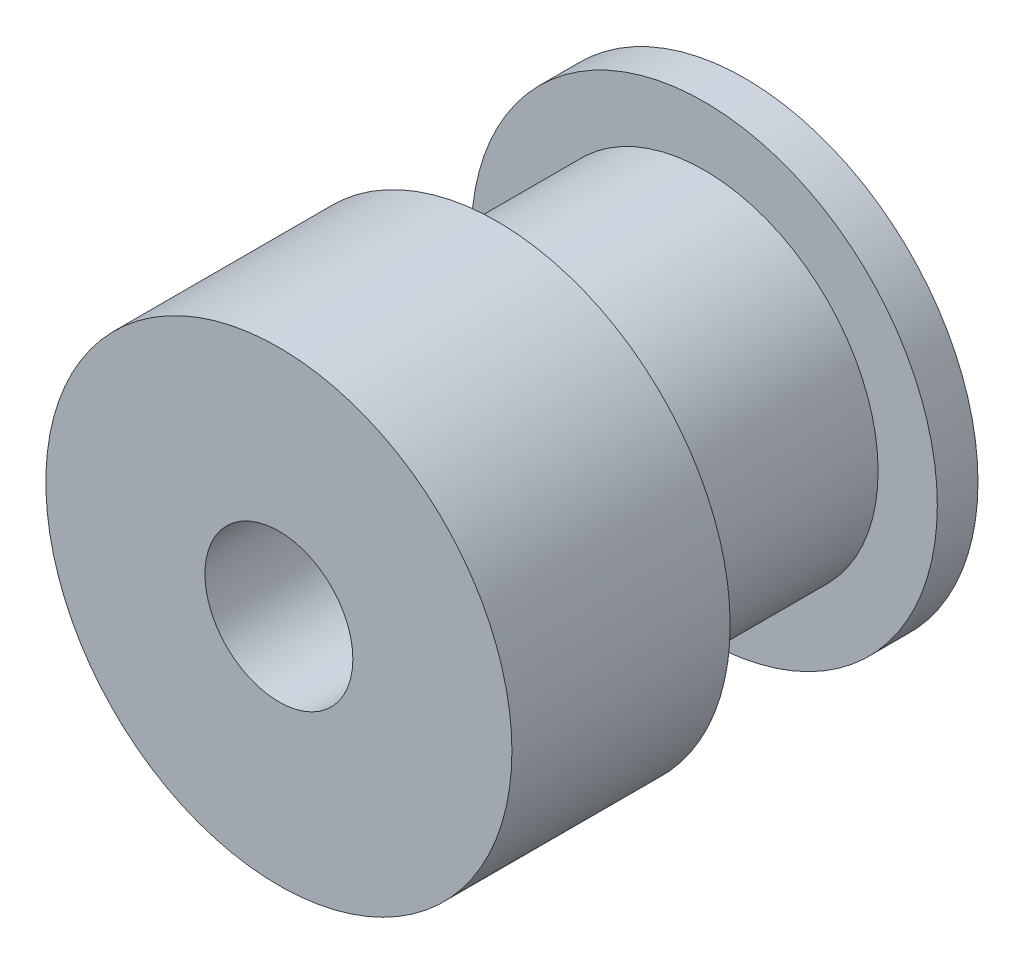
ISO-10303-21;
HEADER;
FILE_DESCRIPTION(('STEP AP214'),'2;1');
FILE_NAME('part.step','',(''),(''),'','','');
FILE_SCHEMA(('AUTOMOTIVE_DESIGN { 1 0 10303 214 1 1 1 1 }'));
ENDSEC;
DATA;
#1=APPLICATION_CONTEXT('core data for automotive mechanical design processes');
#2=APPLICATION_PROTOCOL_DEFINITION('international standard','automotive_design',2000,#1);
#3=PRODUCT_CONTEXT('',#1,'mechanical');
#4=PRODUCT('Part','Part','',(#3));
#5=PRODUCT_RELATED_PRODUCT_CATEGORY('part','',(#4));
#6=PRODUCT_DEFINITION_FORMATION('','',#4);
#7=PRODUCT_DEFINITION_CONTEXT('part definition',#1,'design');
#8=PRODUCT_DEFINITION('design','',#6,#7);
#9=PRODUCT_DEFINITION_SHAPE('','',#8);
#10=(LENGTH_UNIT() NAMED_UNIT(*) SI_UNIT(.MILLI.,.METRE.));
#11=(NAMED_UNIT(*) PLANE_ANGLE_UNIT() SI_UNIT($,.RADIAN.));
#12=(NAMED_UNIT(*) SI_UNIT($,.STERADIAN.) SOLID_ANGLE_UNIT());
#13=UNCERTAINTY_MEASURE_WITH_UNIT(LENGTH_MEASURE(1.E-05),#10,'distance_accuracy_value','');
#14=(GEOMETRIC_REPRESENTATION_CONTEXT(3) GLOBAL_UNCERTAINTY_ASSIGNED_CONTEXT((#13)) GLOBAL_UNIT_ASSIGNED_CONTEXT((#10,
#11,#12)) REPRESENTATION_CONTEXT('',''));
#15=CARTESIAN_POINT('',(0.,0.,0.));
#16=DIRECTION('',(0.,0.,1.));
#17=DIRECTION('',(1.,0.,0.));
#18=AXIS2_PLACEMENT_3D('',#15,#16,#17);
#19=CARTESIAN_POINT('',(8.001,0.,0.));
#20=DIRECTION('',(0.,0.,1.));
#21=DIRECTION('',(1.,0.,0.));
#22=AXIS2_PLACEMENT_3D('',#19,#20,#21);
#23=PLANE('',#22);
#24=CARTESIAN_POINT('',(0.,0.,0.));
#25=DIRECTION('',(0.,0.,1.));
#26=DIRECTION('',(1.,0.,0.));
#27=AXIS2_PLACEMENT_3D('',#24,#25,#26);
#28=CIRCLE('',#27,8.001);
#29=CARTESIAN_POINT('',(8.001,0.,0.));
#30=VERTEX_POINT('',#29);
#31=EDGE_CURVE('E65',#30,#30,#28,.T.);
#32=ORIENTED_EDGE('',*,*,#31,.T.);
#33=EDGE_LOOP('',(#32));
#34=FACE_BOUND('',#33,.T.);
#35=CARTESIAN_POINT('',(0.,0.,0.));
#36=DIRECTION('',(0.,0.,1.));
#37=DIRECTION('',(1.,0.,0.));
#38=AXIS2_PLACEMENT_3D('',#35,#36,#37);
#39=CIRCLE('',#38,2.54);
#40=CARTESIAN_POINT('',(2.54,0.,0.));
#41=VERTEX_POINT('',#40);
#42=EDGE_CURVE('E10',#41,#41,#39,.T.);
#43=ORIENTED_EDGE('',*,*,#42,.F.);
#44=EDGE_LOOP('',(#43));
#45=FACE_BOUND('',#44,.T.);
#46=ADVANCED_FACE('F37',(#34,#45),#23,.T.);
#47=CARTESIAN_POINT('',(0.,0.,0.169544175264491));
#48=DIRECTION('',(0.,0.,1.));
#49=DIRECTION('',(1.,0.,0.));
#50=AXIS2_PLACEMENT_3D('',#47,#48,#49);
#51=CYLINDRICAL_SURFACE('',#50,2.54);
#52=ORIENTED_EDGE('',*,*,#42,.T.);
#53=EDGE_LOOP('',(#52));
#54=FACE_BOUND('',#53,.T.);
#55=CARTESIAN_POINT('',(0.,0.,-16.002));
#56=DIRECTION('',(0.,0.,1.));
#57=DIRECTION('',(1.,0.,0.));
#58=AXIS2_PLACEMENT_3D('',#55,#56,#57);
#59=CIRCLE('',#58,2.54);
#60=CARTESIAN_POINT('',(2.54,0.,-16.002));
#61=VERTEX_POINT('',#60);
#62=EDGE_CURVE('E43',#61,#61,#59,.T.);
#63=ORIENTED_EDGE('',*,*,#62,.F.);
#64=EDGE_LOOP('',(#63));
#65=FACE_BOUND('',#64,.T.);
#66=ADVANCED_FACE('F83',(#54,#65),#51,.F.);
#67=CARTESIAN_POINT('',(2.54,0.,-16.002));
#68=DIRECTION('',(0.,0.,-1.));
#69=DIRECTION('',(-1.,0.,0.));
#70=AXIS2_PLACEMENT_3D('',#67,#68,#69);
#71=PLANE('',#70);
#72=ORIENTED_EDGE('',*,*,#62,.T.);
#73=EDGE_LOOP('',(#72));
#74=FACE_BOUND('',#73,.T.);
#75=CARTESIAN_POINT('',(0.,0.,-16.002));
#76=DIRECTION('',(0.,0.,1.));
#77=DIRECTION('',(1.,0.,0.));
#78=AXIS2_PLACEMENT_3D('',#75,#76,#77);
#79=CIRCLE('',#78,8.001);
#80=CARTESIAN_POINT('',(8.001,0.,-16.002));
#81=VERTEX_POINT('',#80);
#82=EDGE_CURVE('E47',#81,#81,#79,.T.);
#83=ORIENTED_EDGE('',*,*,#82,.F.);
#84=EDGE_LOOP('',(#83));
#85=FACE_BOUND('',#84,.T.);
#86=ADVANCED_FACE('F87',(#74,#85),#71,.T.);
#87=CARTESIAN_POINT('',(0.,0.,0.169544175264491));
#88=DIRECTION('',(0.,0.,1.));
#89=DIRECTION('',(1.,0.,0.));
#90=AXIS2_PLACEMENT_3D('',#87,#88,#89);
#91=CYLINDRICAL_SURFACE('',#90,8.001);
#92=ORIENTED_EDGE('',*,*,#82,.T.);
#93=EDGE_LOOP('',(#92));
#94=FACE_BOUND('',#93,.T.);
#95=CARTESIAN_POINT('',(0.,0.,-14.605));
#96=DIRECTION('',(0.,0.,1.));
#97=DIRECTION('',(1.,0.,0.));
#98=AXIS2_PLACEMENT_3D('',#95,#96,#97);
#99=CIRCLE('',#98,8.001);
#100=CARTESIAN_POINT('',(8.001,0.,-14.605));
#101=VERTEX_POINT('',#100);
#102=EDGE_CURVE('E51',#101,#101,#99,.T.);
#103=ORIENTED_EDGE('',*,*,#102,.F.);
#104=EDGE_LOOP('',(#103));
#105=FACE_BOUND('',#104,.T.);
#106=ADVANCED_FACE('F91',(#94,#105),#91,.T.);
#107=CARTESIAN_POINT('',(8.001,0.,-14.605));
#108=DIRECTION('',(0.,0.,1.));
#109=DIRECTION('',(1.,0.,0.));
#110=AXIS2_PLACEMENT_3D('',#107,#108,#109);
#111=PLANE('',#110);
#112=ORIENTED_EDGE('',*,*,#102,.T.);
#113=EDGE_LOOP('',(#112));
#114=FACE_BOUND('',#113,.T.);
#115=CARTESIAN_POINT('',(0.,0.,-14.605));
#116=DIRECTION('',(0.,0.,1.));
#117=DIRECTION('',(1.,0.,0.));
#118=AXIS2_PLACEMENT_3D('',#115,#116,#117);
#119=CIRCLE('',#118,5.969);
#120=CARTESIAN_POINT('',(5.969,0.,-14.605));
#121=VERTEX_POINT('',#120);
#122=EDGE_CURVE('E56',#121,#121,#119,.T.);
#123=ORIENTED_EDGE('',*,*,#122,.F.);
#124=EDGE_LOOP('',(#123));
#125=FACE_BOUND('',#124,.T.);
#126=ADVANCED_FACE('F97',(#114,#125),#111,.T.);
#127=CARTESIAN_POINT('',(0.,0.,0.169544175264491));
#128=DIRECTION('',(0.,0.,1.));
#129=DIRECTION('',(1.,0.,0.));
#130=AXIS2_PLACEMENT_3D('',#127,#128,#129);
#131=CYLINDRICAL_SURFACE('',#130,5.969);
#132=ORIENTED_EDGE('',*,*,#122,.T.);
#133=EDGE_LOOP('',(#132));
#134=FACE_BOUND('',#133,.T.);
#135=CARTESIAN_POINT('',(0.,0.,-7.493));
#136=DIRECTION('',(0.,0.,1.));
#137=DIRECTION('',(1.,0.,0.));
#138=AXIS2_PLACEMENT_3D('',#135,#136,#137);
#139=CIRCLE('',#138,5.969);
#140=CARTESIAN_POINT('',(5.969,0.,-7.493));
#141=VERTEX_POINT('',#140);
#142=EDGE_CURVE('E59',#141,#141,#139,.T.);
#143=ORIENTED_EDGE('',*,*,#142,.F.);
#144=EDGE_LOOP('',(#143));
#145=FACE_BOUND('',#144,.T.);
#146=ADVANCED_FACE('F79',(#134,#145),#131,.T.);
#147=CARTESIAN_POINT('',(5.969,0.,-7.493));
#148=DIRECTION('',(0.,0.,-1.));
#149=DIRECTION('',(-1.,0.,0.));
#150=AXIS2_PLACEMENT_3D('',#147,#148,#149);
#151=PLANE('',#150);
#152=ORIENTED_EDGE('',*,*,#142,.T.);
#153=EDGE_LOOP('',(#152));
#154=FACE_BOUND('',#153,.T.);
#155=CARTESIAN_POINT('',(0.,0.,-7.493));
#156=DIRECTION('',(0.,0.,1.));
#157=DIRECTION('',(1.,0.,0.));
#158=AXIS2_PLACEMENT_3D('',#155,#156,#157);
#159=CIRCLE('',#158,8.001);
#160=CARTESIAN_POINT('',(8.001,0.,-7.493));
#161=VERTEX_POINT('',#160);
#162=EDGE_CURVE('E62',#161,#161,#159,.T.);
#163=ORIENTED_EDGE('',*,*,#162,.F.);
#164=EDGE_LOOP('',(#163));
#165=FACE_BOUND('',#164,.T.);
#166=ADVANCED_FACE('F73',(#154,#165),#151,.T.);
#167=CARTESIAN_POINT('',(0.,0.,0.169544175264491));
#168=DIRECTION('',(0.,0.,1.));
#169=DIRECTION('',(1.,0.,0.));
#170=AXIS2_PLACEMENT_3D('',#167,#168,#169);
#171=CYLINDRICAL_SURFACE('',#170,8.001);
#172=ORIENTED_EDGE('',*,*,#162,.T.);
#173=EDGE_LOOP('',(#172));
#174=FACE_BOUND('',#173,.T.);
#175=ORIENTED_EDGE('',*,*,#31,.F.);
#176=EDGE_LOOP('',(#175));
#177=FACE_BOUND('',#176,.T.);
#178=ADVANCED_FACE('F71',(#174,#177),#171,.T.);
#179=CLOSED_SHELL('',(#46,#66,#86,#106,#126,#146,#166,#178));
#180=MANIFOLD_SOLID_BREP('B2',#179);
#181=ADVANCED_BREP_SHAPE_REPRESENTATION('',(#18,#180),#14);
#182=SHAPE_DEFINITION_REPRESENTATION(#9,#181);
ENDSEC;
END-ISO-10303-21;
